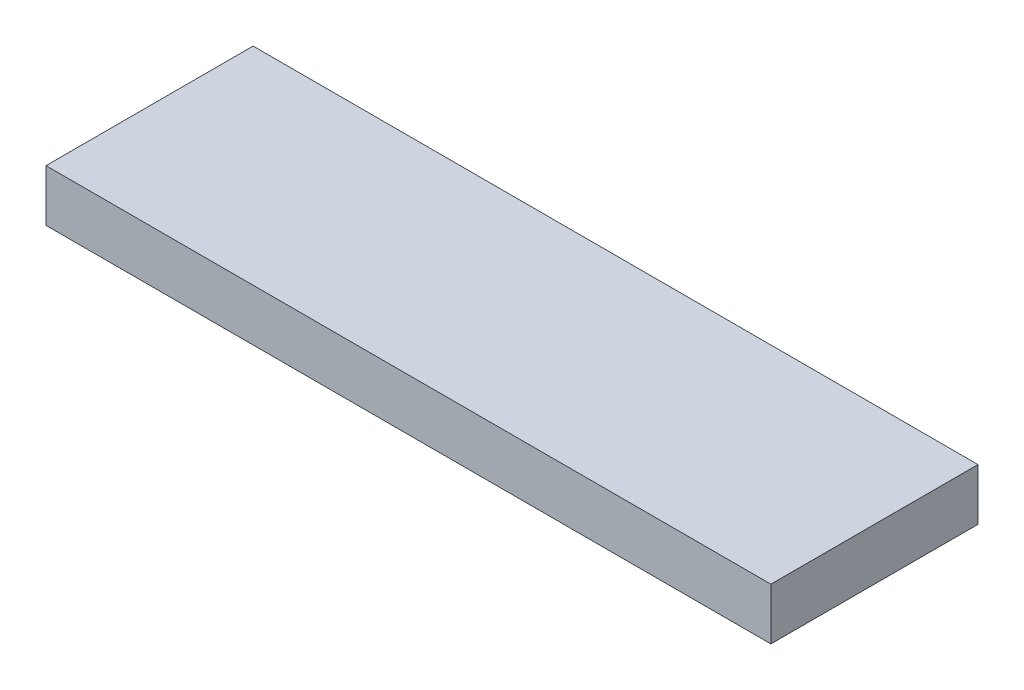
ISO-10303-21;
HEADER;
FILE_DESCRIPTION(('STEP AP214'),'2;1');
FILE_NAME('part.step','',(''),(''),'','','');
FILE_SCHEMA(('AUTOMOTIVE_DESIGN { 1 0 10303 214 1 1 1 1 }'));
ENDSEC;
DATA;
#1=APPLICATION_CONTEXT('core data for automotive mechanical design processes');
#2=APPLICATION_PROTOCOL_DEFINITION('international standard','automotive_design',2000,#1);
#3=PRODUCT_CONTEXT('',#1,'mechanical');
#4=PRODUCT('Part','Part','',(#3));
#5=PRODUCT_RELATED_PRODUCT_CATEGORY('part','',(#4));
#6=PRODUCT_DEFINITION_FORMATION('','',#4);
#7=PRODUCT_DEFINITION_CONTEXT('part definition',#1,'design');
#8=PRODUCT_DEFINITION('design','',#6,#7);
#9=PRODUCT_DEFINITION_SHAPE('','',#8);
#10=(LENGTH_UNIT() NAMED_UNIT(*) SI_UNIT(.MILLI.,.METRE.));
#11=(NAMED_UNIT(*) PLANE_ANGLE_UNIT() SI_UNIT($,.RADIAN.));
#12=(NAMED_UNIT(*) SI_UNIT($,.STERADIAN.) SOLID_ANGLE_UNIT());
#13=UNCERTAINTY_MEASURE_WITH_UNIT(LENGTH_MEASURE(1.E-05),#10,'distance_accuracy_value','');
#14=(GEOMETRIC_REPRESENTATION_CONTEXT(3) GLOBAL_UNCERTAINTY_ASSIGNED_CONTEXT((#13)) GLOBAL_UNIT_ASSIGNED_CONTEXT((#10,
#11,#12)) REPRESENTATION_CONTEXT('',''));
#15=CARTESIAN_POINT('',(0.,0.,0.));
#16=DIRECTION('',(0.,0.,1.));
#17=DIRECTION('',(1.,0.,0.));
#18=AXIS2_PLACEMENT_3D('',#15,#16,#17);
#19=CARTESIAN_POINT('',(-17.78,2.54,-5.08));
#20=DIRECTION('',(1.,0.,0.));
#21=DIRECTION('',(0.,0.,-1.));
#22=AXIS2_PLACEMENT_3D('',#19,#20,#21);
#23=PLANE('',#22);
#24=DIRECTION('',(0.,0.,1.));
#25=VECTOR('',#24,1.);
#26=CARTESIAN_POINT('',(-17.78,0.,-5.08));
#27=LINE('',#26,#25);
#28=CARTESIAN_POINT('',(-17.78,0.,-5.08));
#29=VERTEX_POINT('',#28);
#30=CARTESIAN_POINT('',(-17.78,0.,5.08));
#31=VERTEX_POINT('',#30);
#32=EDGE_CURVE('E94',#29,#31,#27,.T.);
#33=ORIENTED_EDGE('',*,*,#32,.T.);
#34=DIRECTION('',(0.,-1.,0.));
#35=VECTOR('',#34,1.);
#36=CARTESIAN_POINT('',(-17.78,2.54,5.08));
#37=LINE('',#36,#35);
#38=CARTESIAN_POINT('',(-17.78,2.54,5.08));
#39=VERTEX_POINT('',#38);
#40=EDGE_CURVE('E11',#39,#31,#37,.T.);
#41=ORIENTED_EDGE('',*,*,#40,.F.);
#42=DIRECTION('',(0.,0.,1.));
#43=VECTOR('',#42,1.);
#44=CARTESIAN_POINT('',(-17.78,2.54,-5.08));
#45=LINE('',#44,#43);
#46=CARTESIAN_POINT('',(-17.78,2.54,-5.08));
#47=VERTEX_POINT('',#46);
#48=EDGE_CURVE('E82',#47,#39,#45,.T.);
#49=ORIENTED_EDGE('',*,*,#48,.F.);
#50=DIRECTION('',(0.,-1.,0.));
#51=VECTOR('',#50,1.);
#52=CARTESIAN_POINT('',(-17.78,2.54,-5.08));
#53=LINE('',#52,#51);
#54=EDGE_CURVE('E90',#47,#29,#53,.T.);
#55=ORIENTED_EDGE('',*,*,#54,.T.);
#56=EDGE_LOOP('',(#33,#41,#49,#55));
#57=FACE_BOUND('',#56,.T.);
#58=ADVANCED_FACE('F31',(#57),#23,.F.);
#59=CARTESIAN_POINT('',(-17.78,2.54,5.08));
#60=DIRECTION('',(0.,0.,-1.));
#61=DIRECTION('',(-1.,0.,0.));
#62=AXIS2_PLACEMENT_3D('',#59,#60,#61);
#63=PLANE('',#62);
#64=DIRECTION('',(1.,0.,0.));
#65=VECTOR('',#64,1.);
#66=CARTESIAN_POINT('',(-17.78,0.,5.08));
#67=LINE('',#66,#65);
#68=CARTESIAN_POINT('',(17.78,0.,5.08));
#69=VERTEX_POINT('',#68);
#70=EDGE_CURVE('E86',#31,#69,#67,.T.);
#71=ORIENTED_EDGE('',*,*,#70,.T.);
#72=DIRECTION('',(0.,-1.,0.));
#73=VECTOR('',#72,1.);
#74=CARTESIAN_POINT('',(17.78,2.54,5.08));
#75=LINE('',#74,#73);
#76=CARTESIAN_POINT('',(17.78,2.54,5.08));
#77=VERTEX_POINT('',#76);
#78=EDGE_CURVE('E39',#77,#69,#75,.T.);
#79=ORIENTED_EDGE('',*,*,#78,.F.);
#80=DIRECTION('',(1.,0.,0.));
#81=VECTOR('',#80,1.);
#82=CARTESIAN_POINT('',(-17.78,2.54,5.08));
#83=LINE('',#82,#81);
#84=EDGE_CURVE('E77',#39,#77,#83,.T.);
#85=ORIENTED_EDGE('',*,*,#84,.F.);
#86=ORIENTED_EDGE('',*,*,#40,.T.);
#87=EDGE_LOOP('',(#71,#79,#85,#86));
#88=FACE_BOUND('',#87,.T.);
#89=ADVANCED_FACE('F85',(#88),#63,.F.);
#90=CARTESIAN_POINT('',(17.78,2.54,-5.08));
#91=DIRECTION('',(-1.,0.,0.));
#92=DIRECTION('',(0.,0.,1.));
#93=AXIS2_PLACEMENT_3D('',#90,#91,#92);
#94=PLANE('',#93);
#95=DIRECTION('',(0.,0.,-1.));
#96=VECTOR('',#95,1.);
#97=CARTESIAN_POINT('',(17.78,0.,-5.08));
#98=LINE('',#97,#96);
#99=CARTESIAN_POINT('',(17.78,0.,-5.08));
#100=VERTEX_POINT('',#99);
#101=EDGE_CURVE('E64',#69,#100,#98,.T.);
#102=ORIENTED_EDGE('',*,*,#101,.T.);
#103=DIRECTION('',(0.,-1.,0.));
#104=VECTOR('',#103,1.);
#105=CARTESIAN_POINT('',(17.78,2.54,-5.08));
#106=LINE('',#105,#104);
#107=CARTESIAN_POINT('',(17.78,2.54,-5.08));
#108=VERTEX_POINT('',#107);
#109=EDGE_CURVE('E87',#108,#100,#106,.T.);
#110=ORIENTED_EDGE('',*,*,#109,.F.);
#111=DIRECTION('',(0.,0.,-1.));
#112=VECTOR('',#111,1.);
#113=CARTESIAN_POINT('',(17.78,2.54,-5.08));
#114=LINE('',#113,#112);
#115=EDGE_CURVE('E80',#77,#108,#114,.T.);
#116=ORIENTED_EDGE('',*,*,#115,.F.);
#117=ORIENTED_EDGE('',*,*,#78,.T.);
#118=EDGE_LOOP('',(#102,#110,#116,#117));
#119=FACE_BOUND('',#118,.T.);
#120=ADVANCED_FACE('F88',(#119),#94,.F.);
#121=CARTESIAN_POINT('',(-17.78,2.54,-5.08));
#122=DIRECTION('',(0.,0.,1.));
#123=DIRECTION('',(1.,0.,0.));
#124=AXIS2_PLACEMENT_3D('',#121,#122,#123);
#125=PLANE('',#124);
#126=DIRECTION('',(-1.,0.,0.));
#127=VECTOR('',#126,1.);
#128=CARTESIAN_POINT('',(-17.78,0.,-5.08));
#129=LINE('',#128,#127);
#130=EDGE_CURVE('E70',#100,#29,#129,.T.);
#131=ORIENTED_EDGE('',*,*,#130,.T.);
#132=ORIENTED_EDGE('',*,*,#54,.F.);
#133=DIRECTION('',(-1.,0.,0.));
#134=VECTOR('',#133,1.);
#135=CARTESIAN_POINT('',(-17.78,2.54,-5.08));
#136=LINE('',#135,#134);
#137=EDGE_CURVE('E47',#108,#47,#136,.T.);
#138=ORIENTED_EDGE('',*,*,#137,.F.);
#139=ORIENTED_EDGE('',*,*,#109,.T.);
#140=EDGE_LOOP('',(#131,#132,#138,#139));
#141=FACE_BOUND('',#140,.T.);
#142=ADVANCED_FACE('F101',(#141),#125,.F.);
#143=CARTESIAN_POINT('',(-17.78,2.54,5.08));
#144=DIRECTION('',(0.,1.,0.));
#145=DIRECTION('',(0.,0.,1.));
#146=AXIS2_PLACEMENT_3D('',#143,#144,#145);
#147=PLANE('',#146);
#148=ORIENTED_EDGE('',*,*,#48,.T.);
#149=ORIENTED_EDGE('',*,*,#84,.T.);
#150=ORIENTED_EDGE('',*,*,#115,.T.);
#151=ORIENTED_EDGE('',*,*,#137,.T.);
#152=EDGE_LOOP('',(#148,#149,#150,#151));
#153=FACE_BOUND('',#152,.T.);
#154=ADVANCED_FACE('F78',(#153),#147,.T.);
#155=CARTESIAN_POINT('',(-17.78,0.,5.08));
#156=DIRECTION('',(0.,1.,0.));
#157=DIRECTION('',(0.,0.,1.));
#158=AXIS2_PLACEMENT_3D('',#155,#156,#157);
#159=PLANE('',#158);
#160=ORIENTED_EDGE('',*,*,#32,.F.);
#161=ORIENTED_EDGE('',*,*,#130,.F.);
#162=ORIENTED_EDGE('',*,*,#101,.F.);
#163=ORIENTED_EDGE('',*,*,#70,.F.);
#164=EDGE_LOOP('',(#160,#161,#162,#163));
#165=FACE_BOUND('',#164,.T.);
#166=ADVANCED_FACE('F104',(#165),#159,.F.);
#167=CLOSED_SHELL('',(#58,#89,#120,#142,#154,#166));
#168=MANIFOLD_SOLID_BREP('B2',#167);
#169=ADVANCED_BREP_SHAPE_REPRESENTATION('',(#18,#168),#14);
#170=SHAPE_DEFINITION_REPRESENTATION(#9,#169);
ENDSEC;
END-ISO-10303-21;
